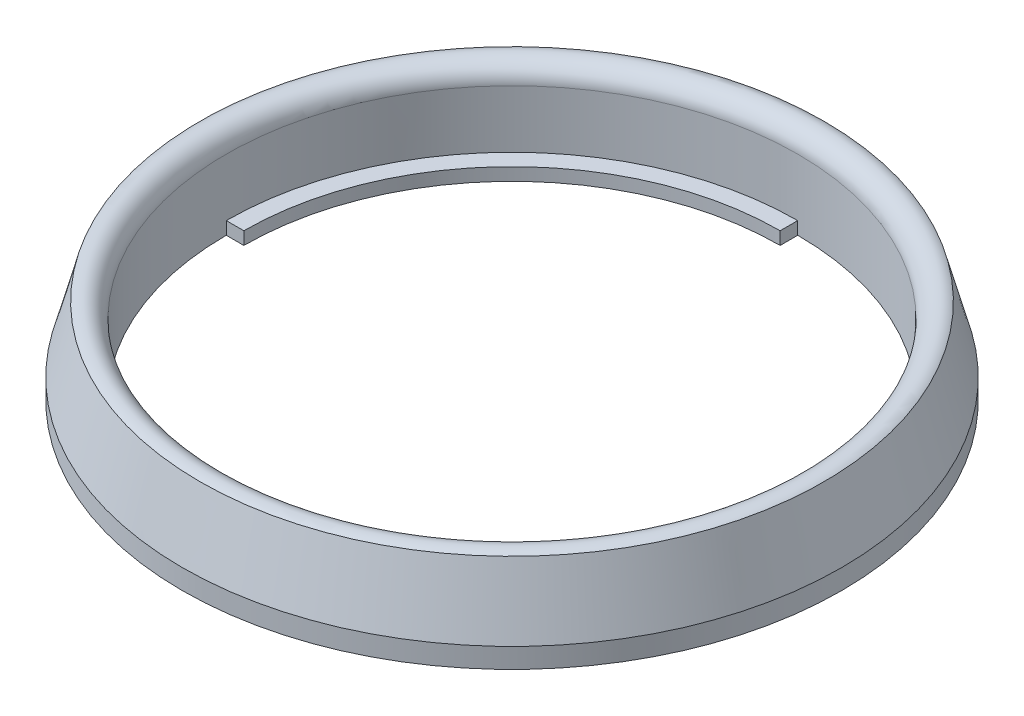
ISO-10303-21;
HEADER;
FILE_DESCRIPTION(('STEP AP214'),'2;1');
FILE_NAME('part.step','',(''),(''),'','','');
FILE_SCHEMA(('AUTOMOTIVE_DESIGN { 1 0 10303 214 1 1 1 1 }'));
ENDSEC;
DATA;
#1=APPLICATION_CONTEXT('core data for automotive mechanical design processes');
#2=APPLICATION_PROTOCOL_DEFINITION('international standard','automotive_design',2000,#1);
#3=PRODUCT_CONTEXT('',#1,'mechanical');
#4=PRODUCT('Part','Part','',(#3));
#5=PRODUCT_RELATED_PRODUCT_CATEGORY('part','',(#4));
#6=PRODUCT_DEFINITION_FORMATION('','',#4);
#7=PRODUCT_DEFINITION_CONTEXT('part definition',#1,'design');
#8=PRODUCT_DEFINITION('design','',#6,#7);
#9=PRODUCT_DEFINITION_SHAPE('','',#8);
#10=(LENGTH_UNIT() NAMED_UNIT(*) SI_UNIT(.MILLI.,.METRE.));
#11=(NAMED_UNIT(*) PLANE_ANGLE_UNIT() SI_UNIT($,.RADIAN.));
#12=(NAMED_UNIT(*) SI_UNIT($,.STERADIAN.) SOLID_ANGLE_UNIT());
#13=UNCERTAINTY_MEASURE_WITH_UNIT(LENGTH_MEASURE(1.E-05),#10,'distance_accuracy_value','');
#14=(GEOMETRIC_REPRESENTATION_CONTEXT(3) GLOBAL_UNCERTAINTY_ASSIGNED_CONTEXT((#13)) GLOBAL_UNIT_ASSIGNED_CONTEXT((#10,
#11,#12)) REPRESENTATION_CONTEXT('',''));
#15=CARTESIAN_POINT('',(0.,0.,0.));
#16=DIRECTION('',(0.,0.,1.));
#17=DIRECTION('',(1.,0.,0.));
#18=AXIS2_PLACEMENT_3D('',#15,#16,#17);
#19=CARTESIAN_POINT('',(37.5,0.,0.));
#20=DIRECTION('',(0.,-1.,0.));
#21=DIRECTION('',(0.,0.,-1.));
#22=AXIS2_PLACEMENT_3D('',#19,#20,#21);
#23=PLANE('',#22);
#24=CARTESIAN_POINT('',(0.,0.,0.));
#25=DIRECTION('',(0.,-1.,0.));
#26=DIRECTION('',(0.,0.,-1.));
#27=AXIS2_PLACEMENT_3D('',#24,#25,#26);
#28=CIRCLE('',#27,37.5);
#29=CARTESIAN_POINT('',(0.,0.,-37.5));
#30=VERTEX_POINT('',#29);
#31=EDGE_CURVE('E11',#30,#30,#28,.T.);
#32=ORIENTED_EDGE('',*,*,#31,.T.);
#33=EDGE_LOOP('',(#32));
#34=FACE_BOUND('',#33,.T.);
#35=CARTESIAN_POINT('',(0.,0.,0.));
#36=DIRECTION('',(0.,1.,0.));
#37=DIRECTION('',(0.,0.,1.));
#38=AXIS2_PLACEMENT_3D('',#35,#36,#37);
#39=CIRCLE('',#38,32.5);
#40=CARTESIAN_POINT('',(32.5,0.,0.));
#41=VERTEX_POINT('',#40);
#42=CARTESIAN_POINT('',(0.,0.,-32.5));
#43=VERTEX_POINT('',#42);
#44=EDGE_CURVE('E102',#41,#43,#39,.T.);
#45=ORIENTED_EDGE('',*,*,#44,.T.);
#46=DIRECTION('',(0.,0.,1.));
#47=VECTOR('',#46,1.);
#48=CARTESIAN_POINT('',(0.,0.,-30.5));
#49=LINE('',#48,#47);
#50=CARTESIAN_POINT('',(0.,0.,-30.5));
#51=VERTEX_POINT('',#50);
#52=EDGE_CURVE('E113',#43,#51,#49,.T.);
#53=ORIENTED_EDGE('',*,*,#52,.T.);
#54=CARTESIAN_POINT('',(0.,0.,0.));
#55=DIRECTION('',(0.,-1.,0.));
#56=DIRECTION('',(0.,0.,-1.));
#57=AXIS2_PLACEMENT_3D('',#54,#55,#56);
#58=CIRCLE('',#57,30.5);
#59=CARTESIAN_POINT('',(-30.5,0.,0.));
#60=VERTEX_POINT('',#59);
#61=EDGE_CURVE('E40',#60,#51,#58,.T.);
#62=ORIENTED_EDGE('',*,*,#61,.F.);
#63=DIRECTION('',(-1.,0.,0.));
#64=VECTOR('',#63,1.);
#65=CARTESIAN_POINT('',(-30.5,0.,0.));
#66=LINE('',#65,#64);
#67=CARTESIAN_POINT('',(-32.5,0.,0.));
#68=VERTEX_POINT('',#67);
#69=EDGE_CURVE('E138',#60,#68,#66,.T.);
#70=ORIENTED_EDGE('',*,*,#69,.T.);
#71=CARTESIAN_POINT('',(0.,0.,0.));
#72=DIRECTION('',(0.,1.,0.));
#73=DIRECTION('',(0.,0.,1.));
#74=AXIS2_PLACEMENT_3D('',#71,#72,#73);
#75=CIRCLE('',#74,32.5);
#76=CARTESIAN_POINT('',(0.,0.,32.5));
#77=VERTEX_POINT('',#76);
#78=EDGE_CURVE('E132',#68,#77,#75,.T.);
#79=ORIENTED_EDGE('',*,*,#78,.T.);
#80=DIRECTION('',(0.,0.,-1.));
#81=VECTOR('',#80,1.);
#82=CARTESIAN_POINT('',(0.,0.,32.5));
#83=LINE('',#82,#81);
#84=CARTESIAN_POINT('',(0.,0.,30.5));
#85=VERTEX_POINT('',#84);
#86=EDGE_CURVE('E135',#77,#85,#83,.T.);
#87=ORIENTED_EDGE('',*,*,#86,.T.);
#88=CARTESIAN_POINT('',(30.5,0.,0.));
#89=VERTEX_POINT('',#88);
#90=EDGE_CURVE('E168',#89,#85,#58,.T.);
#91=ORIENTED_EDGE('',*,*,#90,.F.);
#92=DIRECTION('',(1.,0.,0.));
#93=VECTOR('',#92,1.);
#94=CARTESIAN_POINT('',(32.5,0.,0.));
#95=LINE('',#94,#93);
#96=EDGE_CURVE('E119',#89,#41,#95,.T.);
#97=ORIENTED_EDGE('',*,*,#96,.T.);
#98=EDGE_LOOP('',(#45,#53,#62,#70,#79,#87,#91,#97));
#99=FACE_BOUND('',#98,.T.);
#100=ADVANCED_FACE('F32',(#34,#99),#23,.T.);
#101=CARTESIAN_POINT('',(0.,0.,0.));
#102=DIRECTION('',(0.,-1.,0.));
#103=DIRECTION('',(0.,0.,-1.));
#104=AXIS2_PLACEMENT_3D('',#101,#102,#103);
#105=CYLINDRICAL_SURFACE('',#104,30.5);
#106=ORIENTED_EDGE('',*,*,#61,.T.);
#107=DIRECTION('',(0.,-1.,0.));
#108=VECTOR('',#107,1.);
#109=CARTESIAN_POINT('',(0.,10.,-30.5));
#110=LINE('',#109,#108);
#111=CARTESIAN_POINT('',(0.,1.45,-30.5));
#112=VERTEX_POINT('',#111);
#113=EDGE_CURVE('E110',#112,#51,#110,.T.);
#114=ORIENTED_EDGE('',*,*,#113,.F.);
#115=CARTESIAN_POINT('',(0.,1.45,0.));
#116=DIRECTION('',(0.,-1.,0.));
#117=DIRECTION('',(0.,0.,-1.));
#118=AXIS2_PLACEMENT_3D('',#115,#116,#117);
#119=CIRCLE('',#118,30.5);
#120=CARTESIAN_POINT('',(-30.5,1.45,0.));
#121=VERTEX_POINT('',#120);
#122=EDGE_CURVE('E166',#121,#112,#119,.T.);
#123=ORIENTED_EDGE('',*,*,#122,.F.);
#124=DIRECTION('',(0.,-1.,0.));
#125=VECTOR('',#124,1.);
#126=CARTESIAN_POINT('',(-30.5,10.,0.));
#127=LINE('',#126,#125);
#128=EDGE_CURVE('E55',#121,#60,#127,.T.);
#129=ORIENTED_EDGE('',*,*,#128,.T.);
#130=EDGE_LOOP('',(#106,#114,#123,#129));
#131=FACE_BOUND('',#130,.T.);
#132=ADVANCED_FACE('F192',(#131),#105,.F.);
#133=CARTESIAN_POINT('',(30.5,1.45,0.));
#134=VERTEX_POINT('',#133);
#135=CARTESIAN_POINT('',(0.,1.45,30.5));
#136=VERTEX_POINT('',#135);
#137=EDGE_CURVE('E165',#134,#136,#119,.T.);
#138=ORIENTED_EDGE('',*,*,#137,.F.);
#139=DIRECTION('',(0.,-1.,0.));
#140=VECTOR('',#139,1.);
#141=CARTESIAN_POINT('',(30.5,10.,0.));
#142=LINE('',#141,#140);
#143=EDGE_CURVE('E47',#134,#89,#142,.T.);
#144=ORIENTED_EDGE('',*,*,#143,.T.);
#145=ORIENTED_EDGE('',*,*,#90,.T.);
#146=DIRECTION('',(0.,-1.,0.));
#147=VECTOR('',#146,1.);
#148=CARTESIAN_POINT('',(0.,10.,30.5));
#149=LINE('',#148,#147);
#150=EDGE_CURVE('E144',#136,#85,#149,.T.);
#151=ORIENTED_EDGE('',*,*,#150,.F.);
#152=EDGE_LOOP('',(#138,#144,#145,#151));
#153=FACE_BOUND('',#152,.T.);
#154=ADVANCED_FACE('F173',(#153),#105,.F.);
#155=CARTESIAN_POINT('',(30.5,1.45,0.));
#156=DIRECTION('',(0.,1.,0.));
#157=DIRECTION('',(0.,0.,1.));
#158=AXIS2_PLACEMENT_3D('',#155,#156,#157);
#159=PLANE('',#158);
#160=ORIENTED_EDGE('',*,*,#122,.T.);
#161=DIRECTION('',(0.,0.,-1.));
#162=VECTOR('',#161,1.);
#163=CARTESIAN_POINT('',(0.,1.45,0.));
#164=LINE('',#163,#162);
#165=CARTESIAN_POINT('',(0.,1.45,-32.5));
#166=VERTEX_POINT('',#165);
#167=EDGE_CURVE('E130',#112,#166,#164,.T.);
#168=ORIENTED_EDGE('',*,*,#167,.T.);
#169=CARTESIAN_POINT('',(0.,1.45,0.));
#170=DIRECTION('',(0.,-1.,0.));
#171=DIRECTION('',(0.,0.,-1.));
#172=AXIS2_PLACEMENT_3D('',#169,#170,#171);
#173=CIRCLE('',#172,32.5);
#174=CARTESIAN_POINT('',(-32.5,1.45,0.));
#175=VERTEX_POINT('',#174);
#176=EDGE_CURVE('E106',#175,#166,#173,.T.);
#177=ORIENTED_EDGE('',*,*,#176,.F.);
#178=DIRECTION('',(1.,0.,0.));
#179=VECTOR('',#178,1.);
#180=CARTESIAN_POINT('',(30.5,1.45,2.35315882456163E-13));
#181=LINE('',#180,#179);
#182=EDGE_CURVE('E149',#175,#121,#181,.T.);
#183=ORIENTED_EDGE('',*,*,#182,.T.);
#184=EDGE_LOOP('',(#160,#168,#177,#183));
#185=FACE_BOUND('',#184,.T.);
#186=ADVANCED_FACE('F199',(#185),#159,.T.);
#187=CARTESIAN_POINT('',(32.5,1.45,0.));
#188=VERTEX_POINT('',#187);
#189=CARTESIAN_POINT('',(0.,1.45,32.5));
#190=VERTEX_POINT('',#189);
#191=EDGE_CURVE('E163',#188,#190,#173,.T.);
#192=ORIENTED_EDGE('',*,*,#191,.F.);
#193=DIRECTION('',(-1.,0.,0.));
#194=VECTOR('',#193,1.);
#195=CARTESIAN_POINT('',(30.5,1.45,0.));
#196=LINE('',#195,#194);
#197=EDGE_CURVE('E109',#188,#134,#196,.T.);
#198=ORIENTED_EDGE('',*,*,#197,.T.);
#199=ORIENTED_EDGE('',*,*,#137,.T.);
#200=DIRECTION('',(0.,0.,1.));
#201=VECTOR('',#200,1.);
#202=CARTESIAN_POINT('',(0.,1.45,0.));
#203=LINE('',#202,#201);
#204=EDGE_CURVE('E151',#136,#190,#203,.T.);
#205=ORIENTED_EDGE('',*,*,#204,.T.);
#206=EDGE_LOOP('',(#192,#198,#199,#205));
#207=FACE_BOUND('',#206,.T.);
#208=ADVANCED_FACE('F182',(#207),#159,.T.);
#209=CARTESIAN_POINT('',(0.,0.,0.));
#210=DIRECTION('',(0.,-1.,0.));
#211=DIRECTION('',(0.,0.,-1.));
#212=AXIS2_PLACEMENT_3D('',#209,#210,#211);
#213=CYLINDRICAL_SURFACE('',#212,37.5);
#214=CARTESIAN_POINT('',(0.,2.267949192431,0.));
#215=DIRECTION('',(0.,-1.,0.));
#216=DIRECTION('',(0.,0.,-1.));
#217=AXIS2_PLACEMENT_3D('',#214,#215,#216);
#218=CIRCLE('',#217,37.5);
#219=CARTESIAN_POINT('',(0.,2.267949192431,-37.5));
#220=VERTEX_POINT('',#219);
#221=EDGE_CURVE('E154',#220,#220,#218,.T.);
#222=ORIENTED_EDGE('',*,*,#221,.T.);
#223=EDGE_LOOP('',(#222));
#224=FACE_BOUND('',#223,.T.);
#225=ORIENTED_EDGE('',*,*,#31,.F.);
#226=EDGE_LOOP('',(#225));
#227=FACE_BOUND('',#226,.T.);
#228=ADVANCED_FACE('F34',(#224,#227),#213,.T.);
#229=CARTESIAN_POINT('',(0.,0.,0.));
#230=DIRECTION('',(0.,-1.,0.));
#231=DIRECTION('',(0.,0.,-1.));
#232=AXIS2_PLACEMENT_3D('',#229,#230,#231);
#233=CYLINDRICAL_SURFACE('',#232,32.5);
#234=CARTESIAN_POINT('',(0.,8.,0.));
#235=DIRECTION('',(0.,-1.,0.));
#236=DIRECTION('',(0.,0.,-1.));
#237=AXIS2_PLACEMENT_3D('',#234,#235,#236);
#238=CIRCLE('',#237,32.5);
#239=CARTESIAN_POINT('',(0.,8.,-32.5));
#240=VERTEX_POINT('',#239);
#241=EDGE_CURVE('E160',#240,#240,#238,.T.);
#242=ORIENTED_EDGE('',*,*,#241,.F.);
#243=EDGE_LOOP('',(#242));
#244=FACE_BOUND('',#243,.T.);
#245=ORIENTED_EDGE('',*,*,#176,.T.);
#246=DIRECTION('',(0.,-1.,0.));
#247=VECTOR('',#246,1.);
#248=CARTESIAN_POINT('',(0.,10.,-32.5));
#249=LINE('',#248,#247);
#250=EDGE_CURVE('E97',#166,#43,#249,.T.);
#251=ORIENTED_EDGE('',*,*,#250,.T.);
#252=ORIENTED_EDGE('',*,*,#44,.F.);
#253=DIRECTION('',(0.,-1.,0.));
#254=VECTOR('',#253,1.);
#255=CARTESIAN_POINT('',(32.5,10.,0.));
#256=LINE('',#255,#254);
#257=EDGE_CURVE('E125',#188,#41,#256,.T.);
#258=ORIENTED_EDGE('',*,*,#257,.F.);
#259=ORIENTED_EDGE('',*,*,#191,.T.);
#260=DIRECTION('',(0.,-1.,0.));
#261=VECTOR('',#260,1.);
#262=CARTESIAN_POINT('',(0.,10.,32.5));
#263=LINE('',#262,#261);
#264=EDGE_CURVE('E147',#190,#77,#263,.T.);
#265=ORIENTED_EDGE('',*,*,#264,.T.);
#266=ORIENTED_EDGE('',*,*,#78,.F.);
#267=DIRECTION('',(0.,-1.,0.));
#268=VECTOR('',#267,1.);
#269=CARTESIAN_POINT('',(-32.5,10.,0.));
#270=LINE('',#269,#268);
#271=EDGE_CURVE('E141',#175,#68,#270,.T.);
#272=ORIENTED_EDGE('',*,*,#271,.F.);
#273=EDGE_LOOP('',(#245,#251,#252,#258,#259,#265,#266,#272));
#274=FACE_BOUND('',#273,.T.);
#275=ADVANCED_FACE('F99',(#244,#274),#233,.F.);
#276=CARTESIAN_POINT('',(0.,8.,0.));
#277=DIRECTION('',(0.,-1.,0.));
#278=DIRECTION('',(0.,0.,-1.));
#279=AXIS2_PLACEMENT_3D('',#276,#277,#278);
#280=TOROIDAL_SURFACE('',#279,34.5,2.);
#281=ORIENTED_EDGE('',*,*,#241,.T.);
#282=EDGE_LOOP('',(#281));
#283=FACE_BOUND('',#282,.T.);
#284=CARTESIAN_POINT('',(0.,9.73205080756888,0.));
#285=DIRECTION('',(0.,-1.,0.));
#286=DIRECTION('',(0.,0.,-1.));
#287=AXIS2_PLACEMENT_3D('',#284,#285,#286);
#288=CIRCLE('',#287,35.5);
#289=CARTESIAN_POINT('',(0.,9.73205080756888,-35.5));
#290=VERTEX_POINT('',#289);
#291=EDGE_CURVE('E157',#290,#290,#288,.T.);
#292=ORIENTED_EDGE('',*,*,#291,.F.);
#293=EDGE_LOOP('',(#292));
#294=FACE_BOUND('',#293,.T.);
#295=ADVANCED_FACE('F205',(#283,#294),#280,.T.);
#296=CARTESIAN_POINT('',(0.,2.267949192431,0.));
#297=DIRECTION('',(0.,-1.,0.));
#298=DIRECTION('',(0.,0.,-1.));
#299=AXIS2_PLACEMENT_3D('',#296,#297,#298);
#300=CONICAL_SURFACE('',#299,37.5,0.261799387799144);
#301=ORIENTED_EDGE('',*,*,#291,.T.);
#302=EDGE_LOOP('',(#301));
#303=FACE_BOUND('',#302,.T.);
#304=ORIENTED_EDGE('',*,*,#221,.F.);
#305=EDGE_LOOP('',(#304));
#306=FACE_BOUND('',#305,.T.);
#307=ADVANCED_FACE('F209',(#303,#306),#300,.T.);
#308=CARTESIAN_POINT('',(0.,10.,32.5));
#309=DIRECTION('',(-1.,0.,0.));
#310=DIRECTION('',(0.,0.,1.));
#311=AXIS2_PLACEMENT_3D('',#308,#309,#310);
#312=PLANE('',#311);
#313=ORIENTED_EDGE('',*,*,#150,.T.);
#314=ORIENTED_EDGE('',*,*,#86,.F.);
#315=ORIENTED_EDGE('',*,*,#264,.F.);
#316=ORIENTED_EDGE('',*,*,#204,.F.);
#317=EDGE_LOOP('',(#313,#314,#315,#316));
#318=FACE_BOUND('',#317,.T.);
#319=ADVANCED_FACE('F177',(#318),#312,.T.);
#320=CARTESIAN_POINT('',(-30.5,10.,0.));
#321=DIRECTION('',(0.,0.,1.));
#322=DIRECTION('',(1.,0.,0.));
#323=AXIS2_PLACEMENT_3D('',#320,#321,#322);
#324=PLANE('',#323);
#325=ORIENTED_EDGE('',*,*,#271,.T.);
#326=ORIENTED_EDGE('',*,*,#69,.F.);
#327=ORIENTED_EDGE('',*,*,#128,.F.);
#328=ORIENTED_EDGE('',*,*,#182,.F.);
#329=EDGE_LOOP('',(#325,#326,#327,#328));
#330=FACE_BOUND('',#329,.T.);
#331=ADVANCED_FACE('F189',(#330),#324,.T.);
#332=CARTESIAN_POINT('',(0.,10.,-30.5));
#333=DIRECTION('',(1.,0.,0.));
#334=DIRECTION('',(0.,0.,-1.));
#335=AXIS2_PLACEMENT_3D('',#332,#333,#334);
#336=PLANE('',#335);
#337=ORIENTED_EDGE('',*,*,#113,.T.);
#338=ORIENTED_EDGE('',*,*,#52,.F.);
#339=ORIENTED_EDGE('',*,*,#250,.F.);
#340=ORIENTED_EDGE('',*,*,#167,.F.);
#341=EDGE_LOOP('',(#337,#338,#339,#340));
#342=FACE_BOUND('',#341,.T.);
#343=ADVANCED_FACE('F114',(#342),#336,.T.);
#344=CARTESIAN_POINT('',(32.5,10.,0.));
#345=DIRECTION('',(0.,0.,-1.));
#346=DIRECTION('',(-1.,0.,0.));
#347=AXIS2_PLACEMENT_3D('',#344,#345,#346);
#348=PLANE('',#347);
#349=ORIENTED_EDGE('',*,*,#257,.T.);
#350=ORIENTED_EDGE('',*,*,#96,.F.);
#351=ORIENTED_EDGE('',*,*,#143,.F.);
#352=ORIENTED_EDGE('',*,*,#197,.F.);
#353=EDGE_LOOP('',(#349,#350,#351,#352));
#354=FACE_BOUND('',#353,.T.);
#355=ADVANCED_FACE('F183',(#354),#348,.T.);
#356=CLOSED_SHELL('',(#100,#132,#154,#186,#208,#228,#275,#295,#307,#319,#331,#343,#355));
#357=MANIFOLD_SOLID_BREP('B2',#356);
#358=ADVANCED_BREP_SHAPE_REPRESENTATION('',(#18,#357),#14);
#359=SHAPE_DEFINITION_REPRESENTATION(#9,#358);
ENDSEC;
END-ISO-10303-21;
